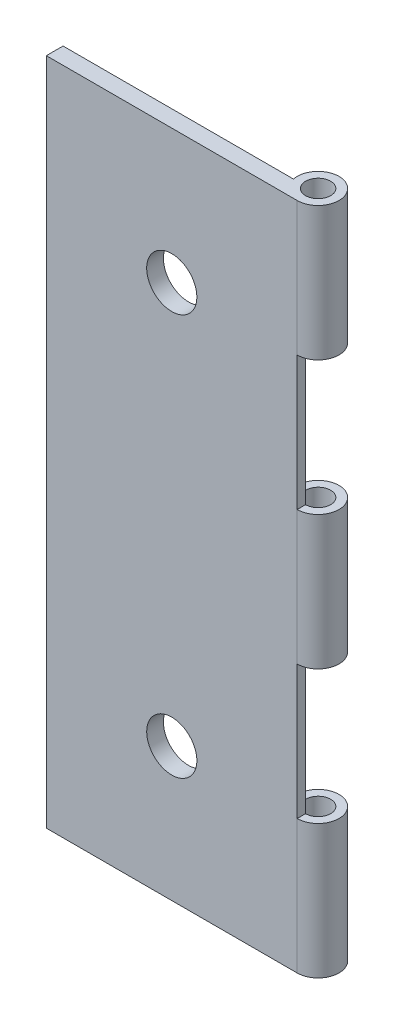
ISO-10303-21;
HEADER;
FILE_DESCRIPTION(('STEP AP214'),'2;1');
FILE_NAME('part.step','',(''),(''),'','','');
FILE_SCHEMA(('AUTOMOTIVE_DESIGN { 1 0 10303 214 1 1 1 1 }'));
ENDSEC;
DATA;
#1=APPLICATION_CONTEXT('core data for automotive mechanical design processes');
#2=APPLICATION_PROTOCOL_DEFINITION('international standard','automotive_design',2000,#1);
#3=PRODUCT_CONTEXT('',#1,'mechanical');
#4=PRODUCT('Part','Part','',(#3));
#5=PRODUCT_RELATED_PRODUCT_CATEGORY('part','',(#4));
#6=PRODUCT_DEFINITION_FORMATION('','',#4);
#7=PRODUCT_DEFINITION_CONTEXT('part definition',#1,'design');
#8=PRODUCT_DEFINITION('design','',#6,#7);
#9=PRODUCT_DEFINITION_SHAPE('','',#8);
#10=(LENGTH_UNIT() NAMED_UNIT(*) SI_UNIT(.MILLI.,.METRE.));
#11=(NAMED_UNIT(*) PLANE_ANGLE_UNIT() SI_UNIT($,.RADIAN.));
#12=(NAMED_UNIT(*) SI_UNIT($,.STERADIAN.) SOLID_ANGLE_UNIT());
#13=UNCERTAINTY_MEASURE_WITH_UNIT(LENGTH_MEASURE(1.E-05),#10,'distance_accuracy_value','');
#14=(GEOMETRIC_REPRESENTATION_CONTEXT(3) GLOBAL_UNCERTAINTY_ASSIGNED_CONTEXT((#13)) GLOBAL_UNIT_ASSIGNED_CONTEXT((#10,
#11,#12)) REPRESENTATION_CONTEXT('',''));
#15=CARTESIAN_POINT('',(0.,0.,0.));
#16=DIRECTION('',(0.,0.,1.));
#17=DIRECTION('',(1.,0.,0.));
#18=AXIS2_PLACEMENT_3D('',#15,#16,#17);
#19=CARTESIAN_POINT('',(7.5,-20.,1.));
#20=DIRECTION('',(-1.,0.,0.));
#21=DIRECTION('',(0.,0.,1.));
#22=AXIS2_PLACEMENT_3D('',#19,#20,#21);
#23=PLANE('',#22);
#24=DIRECTION('',(0.,1.,0.));
#25=VECTOR('',#24,1.);
#26=CARTESIAN_POINT('',(7.5,-20.,1.));
#27=LINE('',#26,#25);
#28=CARTESIAN_POINT('',(7.5,-12.,1.));
#29=VERTEX_POINT('',#28);
#30=CARTESIAN_POINT('',(7.5,-4.,1.));
#31=VERTEX_POINT('',#30);
#32=EDGE_CURVE('E139',#29,#31,#27,.T.);
#33=ORIENTED_EDGE('',*,*,#32,.F.);
#34=DIRECTION('',(0.,0.,-1.));
#35=VECTOR('',#34,1.);
#36=CARTESIAN_POINT('',(7.5,-12.,1.));
#37=LINE('',#36,#35);
#38=CARTESIAN_POINT('',(7.5,-12.,0.499999999999999));
#39=VERTEX_POINT('',#38);
#40=EDGE_CURVE('E126',#29,#39,#37,.T.);
#41=ORIENTED_EDGE('',*,*,#40,.T.);
#42=DIRECTION('',(0.,1.,0.));
#43=VECTOR('',#42,1.);
#44=CARTESIAN_POINT('',(7.5,-20.,0.499999999999999));
#45=LINE('',#44,#43);
#46=CARTESIAN_POINT('',(7.5,-4.,0.499999999999999));
#47=VERTEX_POINT('',#46);
#48=EDGE_CURVE('E137',#39,#47,#45,.T.);
#49=ORIENTED_EDGE('',*,*,#48,.T.);
#50=DIRECTION('',(0.,0.,-1.));
#51=VECTOR('',#50,1.);
#52=CARTESIAN_POINT('',(7.5,-4.,1.));
#53=LINE('',#52,#51);
#54=EDGE_CURVE('E236',#31,#47,#53,.T.);
#55=ORIENTED_EDGE('',*,*,#54,.F.);
#56=EDGE_LOOP('',(#33,#41,#49,#55));
#57=FACE_BOUND('',#56,.T.);
#58=ADVANCED_FACE('F37',(#57),#23,.F.);
#59=CARTESIAN_POINT('',(0.,0.,0.));
#60=DIRECTION('',(0.,0.,-1.));
#61=DIRECTION('',(-1.,0.,0.));
#62=AXIS2_PLACEMENT_3D('',#59,#60,#61);
#63=PLANE('',#62);
#64=DIRECTION('',(0.,1.,0.));
#65=VECTOR('',#64,1.);
#66=CARTESIAN_POINT('',(6.27525512860841,-20.,0.));
#67=LINE('',#66,#65);
#68=CARTESIAN_POINT('',(6.27525512860841,-20.,0.));
#69=VERTEX_POINT('',#68);
#70=CARTESIAN_POINT('',(6.27525512860841,-12.,0.));
#71=VERTEX_POINT('',#70);
#72=EDGE_CURVE('E255',#69,#71,#67,.T.);
#73=ORIENTED_EDGE('',*,*,#72,.F.);
#74=DIRECTION('',(1.,0.,0.));
#75=VECTOR('',#74,1.);
#76=CARTESIAN_POINT('',(-7.5,-20.,0.));
#77=LINE('',#76,#75);
#78=CARTESIAN_POINT('',(-7.5,-20.,0.));
#79=VERTEX_POINT('',#78);
#80=EDGE_CURVE('E193',#79,#69,#77,.T.);
#81=ORIENTED_EDGE('',*,*,#80,.F.);
#82=DIRECTION('',(0.,-1.,0.));
#83=VECTOR('',#82,1.);
#84=CARTESIAN_POINT('',(-7.5,-20.,0.));
#85=LINE('',#84,#83);
#86=CARTESIAN_POINT('',(-7.5,20.,0.));
#87=VERTEX_POINT('',#86);
#88=EDGE_CURVE('E191',#87,#79,#85,.T.);
#89=ORIENTED_EDGE('',*,*,#88,.F.);
#90=DIRECTION('',(-1.,0.,0.));
#91=VECTOR('',#90,1.);
#92=CARTESIAN_POINT('',(-7.5,20.,0.));
#93=LINE('',#92,#91);
#94=CARTESIAN_POINT('',(6.27525512860841,20.,0.));
#95=VERTEX_POINT('',#94);
#96=EDGE_CURVE('E176',#95,#87,#93,.T.);
#97=ORIENTED_EDGE('',*,*,#96,.F.);
#98=DIRECTION('',(0.,1.,0.));
#99=VECTOR('',#98,1.);
#100=CARTESIAN_POINT('',(6.27525512860841,12.,0.));
#101=LINE('',#100,#99);
#102=CARTESIAN_POINT('',(6.27525512860841,12.,0.));
#103=VERTEX_POINT('',#102);
#104=EDGE_CURVE('E161',#103,#95,#101,.T.);
#105=ORIENTED_EDGE('',*,*,#104,.F.);
#106=DIRECTION('',(1.,0.,0.));
#107=VECTOR('',#106,1.);
#108=CARTESIAN_POINT('',(0.,12.,0.));
#109=LINE('',#108,#107);
#110=CARTESIAN_POINT('',(6.79289321881345,12.,0.));
#111=VERTEX_POINT('',#110);
#112=EDGE_CURVE('E163',#103,#111,#109,.T.);
#113=ORIENTED_EDGE('',*,*,#112,.T.);
#114=DIRECTION('',(0.,1.,0.));
#115=VECTOR('',#114,1.);
#116=CARTESIAN_POINT('',(6.79289321881345,-20.,0.));
#117=LINE('',#116,#115);
#118=CARTESIAN_POINT('',(6.79289321881345,4.,0.));
#119=VERTEX_POINT('',#118);
#120=EDGE_CURVE('E229',#119,#111,#117,.T.);
#121=ORIENTED_EDGE('',*,*,#120,.F.);
#122=DIRECTION('',(1.,0.,0.));
#123=VECTOR('',#122,1.);
#124=CARTESIAN_POINT('',(0.,4.,0.));
#125=LINE('',#124,#123);
#126=CARTESIAN_POINT('',(6.27525512860841,4.,0.));
#127=VERTEX_POINT('',#126);
#128=EDGE_CURVE('E221',#127,#119,#125,.T.);
#129=ORIENTED_EDGE('',*,*,#128,.F.);
#130=DIRECTION('',(0.,1.,0.));
#131=VECTOR('',#130,1.);
#132=CARTESIAN_POINT('',(6.27525512860841,-4.,0.));
#133=LINE('',#132,#131);
#134=CARTESIAN_POINT('',(6.27525512860841,-4.,0.));
#135=VERTEX_POINT('',#134);
#136=EDGE_CURVE('E45',#135,#127,#133,.T.);
#137=ORIENTED_EDGE('',*,*,#136,.F.);
#138=DIRECTION('',(1.,0.,0.));
#139=VECTOR('',#138,1.);
#140=CARTESIAN_POINT('',(0.,-4.,0.));
#141=LINE('',#140,#139);
#142=CARTESIAN_POINT('',(6.79289321881345,-4.,0.));
#143=VERTEX_POINT('',#142);
#144=EDGE_CURVE('E231',#135,#143,#141,.T.);
#145=ORIENTED_EDGE('',*,*,#144,.T.);
#146=CARTESIAN_POINT('',(6.79289321881345,-12.,0.));
#147=VERTEX_POINT('',#146);
#148=EDGE_CURVE('E152',#147,#143,#117,.T.);
#149=ORIENTED_EDGE('',*,*,#148,.F.);
#150=DIRECTION('',(1.,0.,0.));
#151=VECTOR('',#150,1.);
#152=CARTESIAN_POINT('',(0.,-12.,0.));
#153=LINE('',#152,#151);
#154=EDGE_CURVE('E129',#71,#147,#153,.T.);
#155=ORIENTED_EDGE('',*,*,#154,.F.);
#156=EDGE_LOOP('',(#73,#81,#89,#97,#105,#113,#121,#129,#137,#145,#149,#155));
#157=FACE_BOUND('',#156,.T.);
#158=CARTESIAN_POINT('',(0.,12.,0.));
#159=DIRECTION('',(0.,0.,1.));
#160=DIRECTION('',(1.,0.,0.));
#161=AXIS2_PLACEMENT_3D('',#158,#159,#160);
#162=CIRCLE('',#161,1.5);
#163=CARTESIAN_POINT('',(1.5,12.,0.));
#164=VERTEX_POINT('',#163);
#165=EDGE_CURVE('E170',#164,#164,#162,.T.);
#166=ORIENTED_EDGE('',*,*,#165,.T.);
#167=EDGE_LOOP('',(#166));
#168=FACE_BOUND('',#167,.T.);
#169=CARTESIAN_POINT('',(0.,-12.,0.));
#170=DIRECTION('',(0.,0.,1.));
#171=DIRECTION('',(-1.,0.,0.));
#172=AXIS2_PLACEMENT_3D('',#169,#170,#171);
#173=CIRCLE('',#172,1.5);
#174=CARTESIAN_POINT('',(-1.5,-12.,0.));
#175=VERTEX_POINT('',#174);
#176=EDGE_CURVE('E166',#175,#175,#173,.T.);
#177=ORIENTED_EDGE('',*,*,#176,.T.);
#178=EDGE_LOOP('',(#177));
#179=FACE_BOUND('',#178,.T.);
#180=ADVANCED_FACE('F227',(#157,#168,#179),#63,.T.);
#181=CARTESIAN_POINT('',(7.5,4.,1.));
#182=VERTEX_POINT('',#181);
#183=CARTESIAN_POINT('',(7.5,12.,1.));
#184=VERTEX_POINT('',#183);
#185=EDGE_CURVE('E182',#182,#184,#27,.T.);
#186=ORIENTED_EDGE('',*,*,#185,.F.);
#187=DIRECTION('',(0.,0.,-1.));
#188=VECTOR('',#187,1.);
#189=CARTESIAN_POINT('',(7.5,4.,1.));
#190=LINE('',#189,#188);
#191=CARTESIAN_POINT('',(7.5,4.,0.499999999999999));
#192=VERTEX_POINT('',#191);
#193=EDGE_CURVE('E224',#182,#192,#190,.T.);
#194=ORIENTED_EDGE('',*,*,#193,.T.);
#195=CARTESIAN_POINT('',(7.5,12.,0.499999999999999));
#196=VERTEX_POINT('',#195);
#197=EDGE_CURVE('E147',#192,#196,#45,.T.);
#198=ORIENTED_EDGE('',*,*,#197,.T.);
#199=DIRECTION('',(0.,0.,-1.));
#200=VECTOR('',#199,1.);
#201=CARTESIAN_POINT('',(7.5,12.,1.));
#202=LINE('',#201,#200);
#203=EDGE_CURVE('E201',#184,#196,#202,.T.);
#204=ORIENTED_EDGE('',*,*,#203,.F.);
#205=EDGE_LOOP('',(#186,#194,#198,#204));
#206=FACE_BOUND('',#205,.T.);
#207=ADVANCED_FACE('F39',(#206),#23,.F.);
#208=CARTESIAN_POINT('',(0.,0.,1.));
#209=DIRECTION('',(0.,0.,-1.));
#210=DIRECTION('',(-1.,0.,0.));
#211=AXIS2_PLACEMENT_3D('',#208,#209,#210);
#212=PLANE('',#211);
#213=CARTESIAN_POINT('',(7.5,-20.,1.));
#214=VERTEX_POINT('',#213);
#215=EDGE_CURVE('E179',#214,#29,#27,.T.);
#216=ORIENTED_EDGE('',*,*,#215,.T.);
#217=ORIENTED_EDGE('',*,*,#32,.T.);
#218=DIRECTION('',(0.,1.,0.));
#219=VECTOR('',#218,1.);
#220=CARTESIAN_POINT('',(7.5,-4.,1.));
#221=LINE('',#220,#219);
#222=EDGE_CURVE('E238',#31,#182,#221,.T.);
#223=ORIENTED_EDGE('',*,*,#222,.T.);
#224=ORIENTED_EDGE('',*,*,#185,.T.);
#225=DIRECTION('',(0.,1.,0.));
#226=VECTOR('',#225,1.);
#227=CARTESIAN_POINT('',(7.5,12.,1.));
#228=LINE('',#227,#226);
#229=CARTESIAN_POINT('',(7.5,20.,1.));
#230=VERTEX_POINT('',#229);
#231=EDGE_CURVE('E157',#184,#230,#228,.T.);
#232=ORIENTED_EDGE('',*,*,#231,.T.);
#233=DIRECTION('',(-1.,0.,0.));
#234=VECTOR('',#233,1.);
#235=CARTESIAN_POINT('',(-7.5,20.,1.));
#236=LINE('',#235,#234);
#237=CARTESIAN_POINT('',(-7.5,20.,1.));
#238=VERTEX_POINT('',#237);
#239=EDGE_CURVE('E181',#230,#238,#236,.T.);
#240=ORIENTED_EDGE('',*,*,#239,.T.);
#241=DIRECTION('',(0.,-1.,0.));
#242=VECTOR('',#241,1.);
#243=CARTESIAN_POINT('',(-7.5,-20.,1.));
#244=LINE('',#243,#242);
#245=CARTESIAN_POINT('',(-7.5,-20.,1.));
#246=VERTEX_POINT('',#245);
#247=EDGE_CURVE('E184',#238,#246,#244,.T.);
#248=ORIENTED_EDGE('',*,*,#247,.T.);
#249=DIRECTION('',(1.,0.,0.));
#250=VECTOR('',#249,1.);
#251=CARTESIAN_POINT('',(-7.5,-20.,1.));
#252=LINE('',#251,#250);
#253=EDGE_CURVE('E186',#246,#214,#252,.T.);
#254=ORIENTED_EDGE('',*,*,#253,.T.);
#255=EDGE_LOOP('',(#216,#217,#223,#224,#232,#240,#248,#254));
#256=FACE_BOUND('',#255,.T.);
#257=CARTESIAN_POINT('',(0.,12.,1.));
#258=DIRECTION('',(0.,0.,1.));
#259=DIRECTION('',(1.,0.,0.));
#260=AXIS2_PLACEMENT_3D('',#257,#258,#259);
#261=CIRCLE('',#260,1.5);
#262=CARTESIAN_POINT('',(1.5,12.,1.));
#263=VERTEX_POINT('',#262);
#264=EDGE_CURVE('E173',#263,#263,#261,.T.);
#265=ORIENTED_EDGE('',*,*,#264,.F.);
#266=EDGE_LOOP('',(#265));
#267=FACE_BOUND('',#266,.T.);
#268=CARTESIAN_POINT('',(0.,-12.,1.));
#269=DIRECTION('',(0.,0.,1.));
#270=DIRECTION('',(-1.,0.,0.));
#271=AXIS2_PLACEMENT_3D('',#268,#269,#270);
#272=CIRCLE('',#271,1.5);
#273=CARTESIAN_POINT('',(-1.5,-12.,1.));
#274=VERTEX_POINT('',#273);
#275=EDGE_CURVE('E167',#274,#274,#272,.T.);
#276=ORIENTED_EDGE('',*,*,#275,.F.);
#277=EDGE_LOOP('',(#276));
#278=FACE_BOUND('',#277,.T.);
#279=ADVANCED_FACE('F280',(#256,#267,#278),#212,.F.);
#280=CARTESIAN_POINT('',(-7.5,20.,1.));
#281=DIRECTION('',(0.,-1.,0.));
#282=DIRECTION('',(0.,0.,-1.));
#283=AXIS2_PLACEMENT_3D('',#280,#281,#282);
#284=PLANE('',#283);
#285=CARTESIAN_POINT('',(7.5,20.,-0.25));
#286=DIRECTION('',(0.,1.,0.));
#287=DIRECTION('',(0.,0.,1.));
#288=AXIS2_PLACEMENT_3D('',#285,#286,#287);
#289=CIRCLE('',#288,0.749999999999999);
#290=CARTESIAN_POINT('',(7.5,20.,0.499999999999999));
#291=VERTEX_POINT('',#290);
#292=EDGE_CURVE('E240',#291,#291,#289,.T.);
#293=ORIENTED_EDGE('',*,*,#292,.F.);
#294=EDGE_LOOP('',(#293));
#295=FACE_BOUND('',#294,.T.);
#296=CARTESIAN_POINT('',(7.5,20.,-0.25));
#297=DIRECTION('',(0.,1.,0.));
#298=DIRECTION('',(0.,0.,1.));
#299=AXIS2_PLACEMENT_3D('',#296,#297,#298);
#300=CIRCLE('',#299,1.25);
#301=EDGE_CURVE('E146',#230,#95,#300,.T.);
#302=ORIENTED_EDGE('',*,*,#301,.T.);
#303=ORIENTED_EDGE('',*,*,#96,.T.);
#304=DIRECTION('',(0.,0.,-1.));
#305=VECTOR('',#304,1.);
#306=CARTESIAN_POINT('',(-7.5,20.,1.));
#307=LINE('',#306,#305);
#308=EDGE_CURVE('E198',#238,#87,#307,.T.);
#309=ORIENTED_EDGE('',*,*,#308,.F.);
#310=ORIENTED_EDGE('',*,*,#239,.F.);
#311=EDGE_LOOP('',(#302,#303,#309,#310));
#312=FACE_BOUND('',#311,.T.);
#313=ADVANCED_FACE('F273',(#295,#312),#284,.F.);
#314=CARTESIAN_POINT('',(-7.5,-20.,1.));
#315=DIRECTION('',(1.,0.,0.));
#316=DIRECTION('',(0.,0.,-1.));
#317=AXIS2_PLACEMENT_3D('',#314,#315,#316);
#318=PLANE('',#317);
#319=ORIENTED_EDGE('',*,*,#88,.T.);
#320=DIRECTION('',(0.,0.,-1.));
#321=VECTOR('',#320,1.);
#322=CARTESIAN_POINT('',(-7.5,-20.,1.));
#323=LINE('',#322,#321);
#324=EDGE_CURVE('E189',#246,#79,#323,.T.);
#325=ORIENTED_EDGE('',*,*,#324,.F.);
#326=ORIENTED_EDGE('',*,*,#247,.F.);
#327=ORIENTED_EDGE('',*,*,#308,.T.);
#328=EDGE_LOOP('',(#319,#325,#326,#327));
#329=FACE_BOUND('',#328,.T.);
#330=ADVANCED_FACE('F268',(#329),#318,.F.);
#331=CARTESIAN_POINT('',(-7.5,-20.,1.));
#332=DIRECTION('',(0.,1.,0.));
#333=DIRECTION('',(0.,0.,1.));
#334=AXIS2_PLACEMENT_3D('',#331,#332,#333);
#335=PLANE('',#334);
#336=CARTESIAN_POINT('',(7.5,-20.,-0.25));
#337=DIRECTION('',(0.,1.,0.));
#338=DIRECTION('',(0.,0.,1.));
#339=AXIS2_PLACEMENT_3D('',#336,#337,#338);
#340=CIRCLE('',#339,0.749999999999999);
#341=CARTESIAN_POINT('',(7.5,-20.,0.499999999999999));
#342=VERTEX_POINT('',#341);
#343=EDGE_CURVE('E247',#342,#342,#340,.T.);
#344=ORIENTED_EDGE('',*,*,#343,.T.);
#345=EDGE_LOOP('',(#344));
#346=FACE_BOUND('',#345,.T.);
#347=ORIENTED_EDGE('',*,*,#80,.T.);
#348=CARTESIAN_POINT('',(7.5,-20.,-0.25));
#349=DIRECTION('',(0.,1.,0.));
#350=DIRECTION('',(0.,0.,1.));
#351=AXIS2_PLACEMENT_3D('',#348,#349,#350);
#352=CIRCLE('',#351,1.25);
#353=EDGE_CURVE('E253',#214,#69,#352,.T.);
#354=ORIENTED_EDGE('',*,*,#353,.F.);
#355=ORIENTED_EDGE('',*,*,#253,.F.);
#356=ORIENTED_EDGE('',*,*,#324,.T.);
#357=EDGE_LOOP('',(#347,#354,#355,#356));
#358=FACE_BOUND('',#357,.T.);
#359=ADVANCED_FACE('F263',(#346,#358),#335,.F.);
#360=CARTESIAN_POINT('',(0.,12.,1.));
#361=DIRECTION('',(0.,0.,-1.));
#362=DIRECTION('',(-1.,0.,0.));
#363=AXIS2_PLACEMENT_3D('',#360,#361,#362);
#364=CYLINDRICAL_SURFACE('',#363,1.5);
#365=ORIENTED_EDGE('',*,*,#264,.T.);
#366=EDGE_LOOP('',(#365));
#367=FACE_BOUND('',#366,.T.);
#368=ORIENTED_EDGE('',*,*,#165,.F.);
#369=EDGE_LOOP('',(#368));
#370=FACE_BOUND('',#369,.T.);
#371=ADVANCED_FACE('F309',(#367,#370),#364,.F.);
#372=CARTESIAN_POINT('',(0.,-12.,1.));
#373=DIRECTION('',(0.,0.,-1.));
#374=DIRECTION('',(-1.,0.,0.));
#375=AXIS2_PLACEMENT_3D('',#372,#373,#374);
#376=CYLINDRICAL_SURFACE('',#375,1.5);
#377=ORIENTED_EDGE('',*,*,#275,.T.);
#378=EDGE_LOOP('',(#377));
#379=FACE_BOUND('',#378,.T.);
#380=ORIENTED_EDGE('',*,*,#176,.F.);
#381=EDGE_LOOP('',(#380));
#382=FACE_BOUND('',#381,.T.);
#383=ADVANCED_FACE('F330',(#379,#382),#376,.F.);
#384=CARTESIAN_POINT('',(7.5,12.,-0.25));
#385=DIRECTION('',(0.,1.,0.));
#386=DIRECTION('',(0.,0.,1.));
#387=AXIS2_PLACEMENT_3D('',#384,#385,#386);
#388=CYLINDRICAL_SURFACE('',#387,1.25);
#389=CARTESIAN_POINT('',(7.5,12.,-0.25));
#390=DIRECTION('',(0.,1.,0.));
#391=DIRECTION('',(0.,0.,1.));
#392=AXIS2_PLACEMENT_3D('',#389,#390,#391);
#393=CIRCLE('',#392,1.25);
#394=EDGE_CURVE('E150',#184,#103,#393,.T.);
#395=ORIENTED_EDGE('',*,*,#394,.T.);
#396=ORIENTED_EDGE('',*,*,#104,.T.);
#397=ORIENTED_EDGE('',*,*,#301,.F.);
#398=ORIENTED_EDGE('',*,*,#231,.F.);
#399=EDGE_LOOP('',(#395,#396,#397,#398));
#400=FACE_BOUND('',#399,.T.);
#401=ADVANCED_FACE('F277',(#400),#388,.T.);
#402=CARTESIAN_POINT('',(7.5,12.,-0.25));
#403=DIRECTION('',(0.,1.,0.));
#404=DIRECTION('',(0.,0.,1.));
#405=AXIS2_PLACEMENT_3D('',#402,#403,#404);
#406=PLANE('',#405);
#407=ORIENTED_EDGE('',*,*,#203,.T.);
#408=CARTESIAN_POINT('',(7.5,12.,-0.25));
#409=DIRECTION('',(0.,1.,0.));
#410=DIRECTION('',(0.,0.,1.));
#411=AXIS2_PLACEMENT_3D('',#408,#409,#410);
#412=CIRCLE('',#411,0.749999999999999);
#413=EDGE_CURVE('E204',#196,#111,#412,.T.);
#414=ORIENTED_EDGE('',*,*,#413,.T.);
#415=ORIENTED_EDGE('',*,*,#112,.F.);
#416=ORIENTED_EDGE('',*,*,#394,.F.);
#417=EDGE_LOOP('',(#407,#414,#415,#416));
#418=FACE_BOUND('',#417,.T.);
#419=ADVANCED_FACE('F285',(#418),#406,.F.);
#420=CARTESIAN_POINT('',(7.5,-20.,-0.25));
#421=DIRECTION('',(0.,1.,0.));
#422=DIRECTION('',(0.,0.,1.));
#423=AXIS2_PLACEMENT_3D('',#420,#421,#422);
#424=CYLINDRICAL_SURFACE('',#423,0.749999999999999);
#425=ORIENTED_EDGE('',*,*,#292,.T.);
#426=EDGE_LOOP('',(#425));
#427=FACE_BOUND('',#426,.T.);
#428=ORIENTED_EDGE('',*,*,#197,.F.);
#429=CARTESIAN_POINT('',(7.5,4.,-0.25));
#430=DIRECTION('',(0.,1.,0.));
#431=DIRECTION('',(0.,0.,1.));
#432=AXIS2_PLACEMENT_3D('',#429,#430,#431);
#433=CIRCLE('',#432,0.749999999999999);
#434=EDGE_CURVE('E60',#192,#119,#433,.T.);
#435=ORIENTED_EDGE('',*,*,#434,.T.);
#436=ORIENTED_EDGE('',*,*,#120,.T.);
#437=ORIENTED_EDGE('',*,*,#413,.F.);
#438=EDGE_LOOP('',(#428,#435,#436,#437));
#439=FACE_BOUND('',#438,.T.);
#440=CARTESIAN_POINT('',(7.5,-4.,-0.25));
#441=DIRECTION('',(0.,1.,0.));
#442=DIRECTION('',(0.,0.,1.));
#443=AXIS2_PLACEMENT_3D('',#440,#441,#442);
#444=CIRCLE('',#443,0.749999999999999);
#445=EDGE_CURVE('E145',#47,#143,#444,.T.);
#446=ORIENTED_EDGE('',*,*,#445,.F.);
#447=ORIENTED_EDGE('',*,*,#48,.F.);
#448=CARTESIAN_POINT('',(7.5,-12.,-0.25));
#449=DIRECTION('',(0.,1.,0.));
#450=DIRECTION('',(0.,0.,1.));
#451=AXIS2_PLACEMENT_3D('',#448,#449,#450);
#452=CIRCLE('',#451,0.749999999999999);
#453=EDGE_CURVE('E11',#39,#147,#452,.T.);
#454=ORIENTED_EDGE('',*,*,#453,.T.);
#455=ORIENTED_EDGE('',*,*,#148,.T.);
#456=EDGE_LOOP('',(#446,#447,#454,#455));
#457=FACE_BOUND('',#456,.T.);
#458=ORIENTED_EDGE('',*,*,#343,.F.);
#459=EDGE_LOOP('',(#458));
#460=FACE_BOUND('',#459,.T.);
#461=ADVANCED_FACE('F143',(#427,#439,#457,#460),#424,.F.);
#462=CARTESIAN_POINT('',(7.5,-4.,-0.25));
#463=DIRECTION('',(0.,1.,0.));
#464=DIRECTION('',(0.,0.,1.));
#465=AXIS2_PLACEMENT_3D('',#462,#463,#464);
#466=CYLINDRICAL_SURFACE('',#465,1.25);
#467=ORIENTED_EDGE('',*,*,#222,.F.);
#468=CARTESIAN_POINT('',(7.5,-4.,-0.25));
#469=DIRECTION('',(0.,1.,0.));
#470=DIRECTION('',(0.,0.,1.));
#471=AXIS2_PLACEMENT_3D('',#468,#469,#470);
#472=CIRCLE('',#471,1.25);
#473=EDGE_CURVE('E215',#31,#135,#472,.T.);
#474=ORIENTED_EDGE('',*,*,#473,.T.);
#475=ORIENTED_EDGE('',*,*,#136,.T.);
#476=CARTESIAN_POINT('',(7.5,4.,-0.25));
#477=DIRECTION('',(0.,1.,0.));
#478=DIRECTION('',(0.,0.,1.));
#479=AXIS2_PLACEMENT_3D('',#476,#477,#478);
#480=CIRCLE('',#479,1.25);
#481=EDGE_CURVE('E141',#182,#127,#480,.T.);
#482=ORIENTED_EDGE('',*,*,#481,.F.);
#483=EDGE_LOOP('',(#467,#474,#475,#482));
#484=FACE_BOUND('',#483,.T.);
#485=ADVANCED_FACE('F212',(#484),#466,.T.);
#486=CARTESIAN_POINT('',(7.5,-4.,-0.25));
#487=DIRECTION('',(0.,1.,0.));
#488=DIRECTION('',(0.,0.,1.));
#489=AXIS2_PLACEMENT_3D('',#486,#487,#488);
#490=PLANE('',#489);
#491=ORIENTED_EDGE('',*,*,#54,.T.);
#492=ORIENTED_EDGE('',*,*,#445,.T.);
#493=ORIENTED_EDGE('',*,*,#144,.F.);
#494=ORIENTED_EDGE('',*,*,#473,.F.);
#495=EDGE_LOOP('',(#491,#492,#493,#494));
#496=FACE_BOUND('',#495,.T.);
#497=ADVANCED_FACE('F246',(#496),#490,.F.);
#498=CARTESIAN_POINT('',(7.5,4.,-0.25));
#499=DIRECTION('',(0.,1.,0.));
#500=DIRECTION('',(0.,0.,1.));
#501=AXIS2_PLACEMENT_3D('',#498,#499,#500);
#502=PLANE('',#501);
#503=ORIENTED_EDGE('',*,*,#434,.F.);
#504=ORIENTED_EDGE('',*,*,#193,.F.);
#505=ORIENTED_EDGE('',*,*,#481,.T.);
#506=ORIENTED_EDGE('',*,*,#128,.T.);
#507=EDGE_LOOP('',(#503,#504,#505,#506));
#508=FACE_BOUND('',#507,.T.);
#509=ADVANCED_FACE('F220',(#508),#502,.T.);
#510=CARTESIAN_POINT('',(7.5,-12.,-0.25));
#511=DIRECTION('',(0.,1.,0.));
#512=DIRECTION('',(0.,0.,1.));
#513=AXIS2_PLACEMENT_3D('',#510,#511,#512);
#514=PLANE('',#513);
#515=ORIENTED_EDGE('',*,*,#453,.F.);
#516=ORIENTED_EDGE('',*,*,#40,.F.);
#517=CARTESIAN_POINT('',(7.5,-12.,-0.25));
#518=DIRECTION('',(0.,1.,0.));
#519=DIRECTION('',(0.,0.,1.));
#520=AXIS2_PLACEMENT_3D('',#517,#518,#519);
#521=CIRCLE('',#520,1.25);
#522=EDGE_CURVE('E52',#29,#71,#521,.T.);
#523=ORIENTED_EDGE('',*,*,#522,.T.);
#524=ORIENTED_EDGE('',*,*,#154,.T.);
#525=EDGE_LOOP('',(#515,#516,#523,#524));
#526=FACE_BOUND('',#525,.T.);
#527=ADVANCED_FACE('F125',(#526),#514,.T.);
#528=CARTESIAN_POINT('',(7.5,-20.,-0.25));
#529=DIRECTION('',(0.,1.,0.));
#530=DIRECTION('',(0.,0.,1.));
#531=AXIS2_PLACEMENT_3D('',#528,#529,#530);
#532=CYLINDRICAL_SURFACE('',#531,1.25);
#533=ORIENTED_EDGE('',*,*,#353,.T.);
#534=ORIENTED_EDGE('',*,*,#72,.T.);
#535=ORIENTED_EDGE('',*,*,#522,.F.);
#536=ORIENTED_EDGE('',*,*,#215,.F.);
#537=EDGE_LOOP('',(#533,#534,#535,#536));
#538=FACE_BOUND('',#537,.T.);
#539=ADVANCED_FACE('F258',(#538),#532,.T.);
#540=CLOSED_SHELL('',(#58,#180,#207,#279,#313,#330,#359,#371,#383,#401,#419,#461,#485,#497,#509,
#527,#539));
#541=MANIFOLD_SOLID_BREP('B2',#540);
#542=ADVANCED_BREP_SHAPE_REPRESENTATION('',(#18,#541),#14);
#543=SHAPE_DEFINITION_REPRESENTATION(#9,#542);
ENDSEC;
END-ISO-10303-21;
